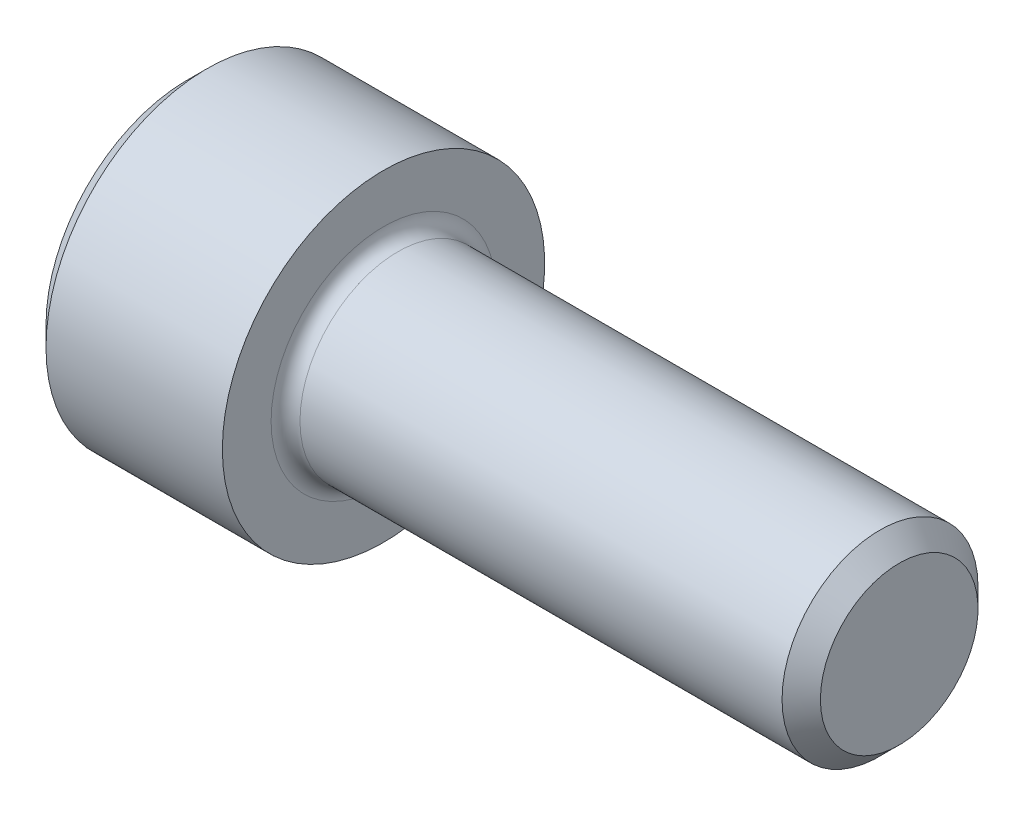
ISO-10303-21;
HEADER;
FILE_DESCRIPTION(('STEP AP214'),'2;1');
FILE_NAME('part.step','',(''),(''),'','','');
FILE_SCHEMA(('AUTOMOTIVE_DESIGN { 1 0 10303 214 1 1 1 1 }'));
ENDSEC;
DATA;
#1=APPLICATION_CONTEXT('core data for automotive mechanical design processes');
#2=APPLICATION_PROTOCOL_DEFINITION('international standard','automotive_design',2000,#1);
#3=PRODUCT_CONTEXT('',#1,'mechanical');
#4=PRODUCT('Part','Part','',(#3));
#5=PRODUCT_RELATED_PRODUCT_CATEGORY('part','',(#4));
#6=PRODUCT_DEFINITION_FORMATION('','',#4);
#7=PRODUCT_DEFINITION_CONTEXT('part definition',#1,'design');
#8=PRODUCT_DEFINITION('design','',#6,#7);
#9=PRODUCT_DEFINITION_SHAPE('','',#8);
#10=(LENGTH_UNIT() NAMED_UNIT(*) SI_UNIT(.MILLI.,.METRE.));
#11=(NAMED_UNIT(*) PLANE_ANGLE_UNIT() SI_UNIT($,.RADIAN.));
#12=(NAMED_UNIT(*) SI_UNIT($,.STERADIAN.) SOLID_ANGLE_UNIT());
#13=UNCERTAINTY_MEASURE_WITH_UNIT(LENGTH_MEASURE(1.E-05),#10,'distance_accuracy_value','');
#14=(GEOMETRIC_REPRESENTATION_CONTEXT(3) GLOBAL_UNCERTAINTY_ASSIGNED_CONTEXT((#13)) GLOBAL_UNIT_ASSIGNED_CONTEXT((#10,
#11,#12)) REPRESENTATION_CONTEXT('',''));
#15=CARTESIAN_POINT('',(0.,0.,0.));
#16=DIRECTION('',(0.,0.,1.));
#17=DIRECTION('',(1.,0.,0.));
#18=AXIS2_PLACEMENT_3D('',#15,#16,#17);
#19=CARTESIAN_POINT('',(0.,0.,0.));
#20=DIRECTION('',(-1.,0.,0.));
#21=DIRECTION('',(0.,0.,1.));
#22=AXIS2_PLACEMENT_3D('',#19,#20,#21);
#23=PLANE('',#22);
#24=DIRECTION('',(0.,-0.499999999999998,0.86602540378444));
#25=VECTOR('',#24,1.);
#26=CARTESIAN_POINT('',(0.,2.2920921156882,0.));
#27=LINE('',#26,#25);
#28=CARTESIAN_POINT('',(0.,2.2920921156882,0.));
#29=VERTEX_POINT('',#28);
#30=CARTESIAN_POINT('',(0.,1.14604605784411,1.98501));
#31=VERTEX_POINT('',#30);
#32=EDGE_CURVE('E270',#29,#31,#27,.T.);
#33=ORIENTED_EDGE('',*,*,#32,.T.);
#34=DIRECTION('',(0.,1.,0.));
#35=VECTOR('',#34,1.);
#36=CARTESIAN_POINT('',(0.,-1.14604605784409,1.98501));
#37=LINE('',#36,#35);
#38=CARTESIAN_POINT('',(0.,-1.14604605784409,1.98501));
#39=VERTEX_POINT('',#38);
#40=EDGE_CURVE('E130',#39,#31,#37,.T.);
#41=ORIENTED_EDGE('',*,*,#40,.F.);
#42=DIRECTION('',(0.,-0.500000000000001,-0.866025403784438));
#43=VECTOR('',#42,1.);
#44=CARTESIAN_POINT('',(0.,-1.14604605784409,1.98501));
#45=LINE('',#44,#43);
#46=CARTESIAN_POINT('',(0.,-2.29209211568819,0.));
#47=VERTEX_POINT('',#46);
#48=EDGE_CURVE('E273',#39,#47,#45,.T.);
#49=ORIENTED_EDGE('',*,*,#48,.T.);
#50=DIRECTION('',(0.,0.499999999999999,-0.86602540378444));
#51=VECTOR('',#50,1.);
#52=CARTESIAN_POINT('',(0.,-2.29209211568819,0.));
#53=LINE('',#52,#51);
#54=CARTESIAN_POINT('',(0.,-1.1460460578441,-1.98501));
#55=VERTEX_POINT('',#54);
#56=EDGE_CURVE('E276',#47,#55,#53,.T.);
#57=ORIENTED_EDGE('',*,*,#56,.T.);
#58=DIRECTION('',(0.,-1.,0.));
#59=VECTOR('',#58,1.);
#60=CARTESIAN_POINT('',(0.,1.1460460578441,-1.98501));
#61=LINE('',#60,#59);
#62=CARTESIAN_POINT('',(0.,1.1460460578441,-1.98501));
#63=VERTEX_POINT('',#62);
#64=EDGE_CURVE('E279',#63,#55,#61,.T.);
#65=ORIENTED_EDGE('',*,*,#64,.F.);
#66=DIRECTION('',(0.,-0.500000000000002,-0.866025403784438));
#67=VECTOR('',#66,1.);
#68=CARTESIAN_POINT('',(0.,2.2920921156882,0.));
#69=LINE('',#68,#67);
#70=EDGE_CURVE('E125',#29,#63,#69,.T.);
#71=ORIENTED_EDGE('',*,*,#70,.F.);
#72=EDGE_LOOP('',(#33,#41,#49,#57,#65,#71));
#73=FACE_BOUND('',#72,.T.);
#74=CARTESIAN_POINT('',(0.,0.,0.));
#75=DIRECTION('',(-1.,0.,0.));
#76=DIRECTION('',(0.,0.,1.));
#77=AXIS2_PLACEMENT_3D('',#74,#75,#76);
#78=CIRCLE('',#77,3.48615);
#79=CARTESIAN_POINT('',(0.,0.,3.48615));
#80=VERTEX_POINT('',#79);
#81=EDGE_CURVE('E154',#80,#80,#78,.T.);
#82=ORIENTED_EDGE('',*,*,#81,.T.);
#83=EDGE_LOOP('',(#82));
#84=FACE_BOUND('',#83,.T.);
#85=ADVANCED_FACE('F38',(#73,#84),#23,.T.);
#86=CARTESIAN_POINT('',(0.,0.,0.));
#87=DIRECTION('',(1.,0.,0.));
#88=DIRECTION('',(0.,0.,-1.));
#89=AXIS2_PLACEMENT_3D('',#86,#87,#88);
#90=CONICAL_SURFACE('',#89,3.48615,0.785398163397451);
#91=CARTESIAN_POINT('',(0.4826,0.,0.));
#92=DIRECTION('',(-1.,0.,0.));
#93=DIRECTION('',(0.,0.,1.));
#94=AXIS2_PLACEMENT_3D('',#91,#92,#93);
#95=CIRCLE('',#94,3.96875);
#96=CARTESIAN_POINT('',(0.4826,0.,3.96875));
#97=VERTEX_POINT('',#96);
#98=EDGE_CURVE('E151',#97,#97,#95,.T.);
#99=ORIENTED_EDGE('',*,*,#98,.T.);
#100=EDGE_LOOP('',(#99));
#101=FACE_BOUND('',#100,.T.);
#102=ORIENTED_EDGE('',*,*,#81,.F.);
#103=EDGE_LOOP('',(#102));
#104=FACE_BOUND('',#103,.T.);
#105=ADVANCED_FACE('F175',(#101,#104),#90,.T.);
#106=CARTESIAN_POINT('',(-31.75,0.,0.));
#107=DIRECTION('',(-1.,0.,0.));
#108=DIRECTION('',(0.,0.,1.));
#109=AXIS2_PLACEMENT_3D('',#106,#107,#108);
#110=CYLINDRICAL_SURFACE('',#109,3.96875);
#111=CARTESIAN_POINT('',(4.826,0.,0.));
#112=DIRECTION('',(-1.,0.,0.));
#113=DIRECTION('',(0.,0.,1.));
#114=AXIS2_PLACEMENT_3D('',#111,#112,#113);
#115=CIRCLE('',#114,3.96875);
#116=CARTESIAN_POINT('',(4.826,0.,3.96875));
#117=VERTEX_POINT('',#116);
#118=EDGE_CURVE('E148',#117,#117,#115,.T.);
#119=ORIENTED_EDGE('',*,*,#118,.T.);
#120=EDGE_LOOP('',(#119));
#121=FACE_BOUND('',#120,.T.);
#122=ORIENTED_EDGE('',*,*,#98,.F.);
#123=EDGE_LOOP('',(#122));
#124=FACE_BOUND('',#123,.T.);
#125=ADVANCED_FACE('F180',(#121,#124),#110,.T.);
#126=CARTESIAN_POINT('',(4.826,3.96875,0.));
#127=DIRECTION('',(1.,0.,0.));
#128=DIRECTION('',(0.,0.,-1.));
#129=AXIS2_PLACEMENT_3D('',#126,#127,#128);
#130=PLANE('',#129);
#131=CARTESIAN_POINT('',(4.826,0.,0.));
#132=DIRECTION('',(1.,0.,0.));
#133=DIRECTION('',(0.,0.,-1.));
#134=AXIS2_PLACEMENT_3D('',#131,#132,#133);
#135=CIRCLE('',#134,2.76859999999999);
#136=CARTESIAN_POINT('',(4.826,0.,-2.76859999999999));
#137=VERTEX_POINT('',#136);
#138=EDGE_CURVE('E46',#137,#137,#135,.F.);
#139=ORIENTED_EDGE('',*,*,#138,.T.);
#140=EDGE_LOOP('',(#139));
#141=FACE_BOUND('',#140,.T.);
#142=ORIENTED_EDGE('',*,*,#118,.F.);
#143=EDGE_LOOP('',(#142));
#144=FACE_BOUND('',#143,.T.);
#145=ADVANCED_FACE('F159',(#141,#144),#130,.T.);
#146=CARTESIAN_POINT('',(-31.75,0.,0.));
#147=DIRECTION('',(-1.,0.,0.));
#148=DIRECTION('',(0.,0.,1.));
#149=AXIS2_PLACEMENT_3D('',#146,#147,#148);
#150=CYLINDRICAL_SURFACE('',#149,2.41299999999999);
#151=CARTESIAN_POINT('',(5.1816,0.,0.));
#152=DIRECTION('',(1.,0.,0.));
#153=DIRECTION('',(0.,0.,-1.));
#154=AXIS2_PLACEMENT_3D('',#151,#152,#153);
#155=CIRCLE('',#154,2.41299999999999);
#156=CARTESIAN_POINT('',(5.1816,0.,-2.41299999999999));
#157=VERTEX_POINT('',#156);
#158=EDGE_CURVE('E11',#157,#157,#155,.T.);
#159=ORIENTED_EDGE('',*,*,#158,.T.);
#160=EDGE_LOOP('',(#159));
#161=FACE_BOUND('',#160,.T.);
#162=CARTESIAN_POINT('',(17.05356,0.,0.));
#163=DIRECTION('',(-1.,0.,0.));
#164=DIRECTION('',(0.,0.,1.));
#165=AXIS2_PLACEMENT_3D('',#162,#163,#164);
#166=CIRCLE('',#165,2.41299999999997);
#167=CARTESIAN_POINT('',(17.05356,0.,2.41299999999997));
#168=VERTEX_POINT('',#167);
#169=EDGE_CURVE('E145',#168,#168,#166,.T.);
#170=ORIENTED_EDGE('',*,*,#169,.T.);
#171=EDGE_LOOP('',(#170));
#172=FACE_BOUND('',#171,.T.);
#173=ADVANCED_FACE('F190',(#161,#172),#150,.T.);
#174=CARTESIAN_POINT('',(17.526,0.,0.));
#175=DIRECTION('',(-1.,0.,0.));
#176=DIRECTION('',(0.,0.,1.));
#177=AXIS2_PLACEMENT_3D('',#174,#175,#176);
#178=CONICAL_SURFACE('',#177,1.94056,0.7853981633974);
#179=ORIENTED_EDGE('',*,*,#169,.F.);
#180=EDGE_LOOP('',(#179));
#181=FACE_BOUND('',#180,.T.);
#182=CARTESIAN_POINT('',(17.526,0.,0.));
#183=DIRECTION('',(-1.,0.,0.));
#184=DIRECTION('',(0.,0.,1.));
#185=AXIS2_PLACEMENT_3D('',#182,#183,#184);
#186=CIRCLE('',#185,1.94056);
#187=CARTESIAN_POINT('',(17.526,0.,1.94056));
#188=VERTEX_POINT('',#187);
#189=EDGE_CURVE('E141',#188,#188,#186,.T.);
#190=ORIENTED_EDGE('',*,*,#189,.T.);
#191=EDGE_LOOP('',(#190));
#192=FACE_BOUND('',#191,.T.);
#193=ADVANCED_FACE('F170',(#181,#192),#178,.T.);
#194=CARTESIAN_POINT('',(17.526,1.94056,0.));
#195=DIRECTION('',(1.,0.,0.));
#196=DIRECTION('',(0.,0.,-1.));
#197=AXIS2_PLACEMENT_3D('',#194,#195,#196);
#198=PLANE('',#197);
#199=ORIENTED_EDGE('',*,*,#189,.F.);
#200=EDGE_LOOP('',(#199));
#201=FACE_BOUND('',#200,.T.);
#202=ADVANCED_FACE('F163',(#201),#198,.T.);
#203=CARTESIAN_POINT('',(5.1816,0.,0.));
#204=DIRECTION('',(1.,0.,0.));
#205=DIRECTION('',(0.,0.,-1.));
#206=AXIS2_PLACEMENT_3D('',#203,#204,#205);
#207=TOROIDAL_SURFACE('',#206,2.76859999999999,0.3556);
#208=ORIENTED_EDGE('',*,*,#158,.F.);
#209=EDGE_LOOP('',(#208));
#210=FACE_BOUND('',#209,.T.);
#211=ORIENTED_EDGE('',*,*,#138,.F.);
#212=EDGE_LOOP('',(#211));
#213=FACE_BOUND('',#212,.T.);
#214=ADVANCED_FACE('F40',(#210,#213),#207,.F.);
#215=CARTESIAN_POINT('',(2.286,2.2920921156882,0.));
#216=DIRECTION('',(0.,-0.866025403784439,-0.499999999999998));
#217=DIRECTION('',(0.,0.499999999999998,-0.86602540378444));
#218=AXIS2_PLACEMENT_3D('',#215,#216,#217);
#219=PLANE('',#218);
#220=ORIENTED_EDGE('',*,*,#32,.F.);
#221=DIRECTION('',(-1.,0.,0.));
#222=VECTOR('',#221,1.);
#223=CARTESIAN_POINT('',(2.286,2.2920921156882,0.));
#224=LINE('',#223,#222);
#225=CARTESIAN_POINT('',(2.286,2.2920921156882,0.));
#226=VERTEX_POINT('',#225);
#227=EDGE_CURVE('E269',#226,#29,#224,.T.);
#228=ORIENTED_EDGE('',*,*,#227,.F.);
#229=DIRECTION('',(0.,-0.499999999999998,0.86602540378444));
#230=VECTOR('',#229,1.);
#231=CARTESIAN_POINT('',(2.286,2.2920921156882,0.));
#232=LINE('',#231,#230);
#233=CARTESIAN_POINT('',(2.286,1.71906908676615,0.992504999999996));
#234=VERTEX_POINT('',#233);
#235=EDGE_CURVE('E53',#226,#234,#232,.T.);
#236=ORIENTED_EDGE('',*,*,#235,.T.);
#237=CARTESIAN_POINT('',(2.286,1.14604605784411,1.98501));
#238=VERTEX_POINT('',#237);
#239=EDGE_CURVE('E111',#234,#238,#232,.T.);
#240=ORIENTED_EDGE('',*,*,#239,.T.);
#241=DIRECTION('',(-1.,0.,0.));
#242=VECTOR('',#241,1.);
#243=CARTESIAN_POINT('',(2.286,1.14604605784411,1.98501));
#244=LINE('',#243,#242);
#245=EDGE_CURVE('E123',#238,#31,#244,.T.);
#246=ORIENTED_EDGE('',*,*,#245,.T.);
#247=EDGE_LOOP('',(#220,#228,#236,#240,#246));
#248=FACE_BOUND('',#247,.T.);
#249=ADVANCED_FACE('F122',(#248),#219,.T.);
#250=CARTESIAN_POINT('',(2.286,-1.14604605784409,1.98501));
#251=DIRECTION('',(0.,0.,1.));
#252=DIRECTION('',(0.,-1.,0.));
#253=AXIS2_PLACEMENT_3D('',#250,#251,#252);
#254=PLANE('',#253);
#255=ORIENTED_EDGE('',*,*,#40,.T.);
#256=ORIENTED_EDGE('',*,*,#245,.F.);
#257=DIRECTION('',(0.,1.,0.));
#258=VECTOR('',#257,1.);
#259=CARTESIAN_POINT('',(2.286,-1.14604605784409,1.98501));
#260=LINE('',#259,#258);
#261=CARTESIAN_POINT('',(2.286,0.,1.98501));
#262=VERTEX_POINT('',#261);
#263=EDGE_CURVE('E109',#262,#238,#260,.T.);
#264=ORIENTED_EDGE('',*,*,#263,.F.);
#265=CARTESIAN_POINT('',(2.286,-1.14604605784409,1.98501));
#266=VERTEX_POINT('',#265);
#267=EDGE_CURVE('E119',#266,#262,#260,.T.);
#268=ORIENTED_EDGE('',*,*,#267,.F.);
#269=DIRECTION('',(-1.,0.,0.));
#270=VECTOR('',#269,1.);
#271=CARTESIAN_POINT('',(2.286,-1.14604605784409,1.98501));
#272=LINE('',#271,#270);
#273=EDGE_CURVE('E132',#266,#39,#272,.T.);
#274=ORIENTED_EDGE('',*,*,#273,.T.);
#275=EDGE_LOOP('',(#255,#256,#264,#268,#274));
#276=FACE_BOUND('',#275,.T.);
#277=ADVANCED_FACE('F127',(#276),#254,.F.);
#278=CARTESIAN_POINT('',(2.286,-1.14604605784409,1.98501));
#279=DIRECTION('',(0.,0.866025403784438,-0.500000000000001));
#280=DIRECTION('',(0.,0.500000000000001,0.866025403784438));
#281=AXIS2_PLACEMENT_3D('',#278,#279,#280);
#282=PLANE('',#281);
#283=ORIENTED_EDGE('',*,*,#48,.F.);
#284=ORIENTED_EDGE('',*,*,#273,.F.);
#285=DIRECTION('',(0.,-0.500000000000001,-0.866025403784438));
#286=VECTOR('',#285,1.);
#287=CARTESIAN_POINT('',(2.286,-1.14604605784409,1.98501));
#288=LINE('',#287,#286);
#289=CARTESIAN_POINT('',(2.286,-1.71906908676614,0.992505));
#290=VERTEX_POINT('',#289);
#291=EDGE_CURVE('E250',#266,#290,#288,.T.);
#292=ORIENTED_EDGE('',*,*,#291,.T.);
#293=CARTESIAN_POINT('',(2.286,-2.29209211568819,0.));
#294=VERTEX_POINT('',#293);
#295=EDGE_CURVE('E252',#290,#294,#288,.T.);
#296=ORIENTED_EDGE('',*,*,#295,.T.);
#297=DIRECTION('',(-1.,0.,0.));
#298=VECTOR('',#297,1.);
#299=CARTESIAN_POINT('',(2.286,-2.29209211568819,0.));
#300=LINE('',#299,#298);
#301=EDGE_CURVE('E137',#294,#47,#300,.T.);
#302=ORIENTED_EDGE('',*,*,#301,.T.);
#303=EDGE_LOOP('',(#283,#284,#292,#296,#302));
#304=FACE_BOUND('',#303,.T.);
#305=ADVANCED_FACE('F202',(#304),#282,.T.);
#306=CARTESIAN_POINT('',(2.286,-2.29209211568819,0.));
#307=DIRECTION('',(0.,0.866025403784439,0.499999999999999));
#308=DIRECTION('',(0.,-0.499999999999999,0.866025403784439));
#309=AXIS2_PLACEMENT_3D('',#306,#307,#308);
#310=PLANE('',#309);
#311=ORIENTED_EDGE('',*,*,#56,.F.);
#312=ORIENTED_EDGE('',*,*,#301,.F.);
#313=DIRECTION('',(0.,0.499999999999999,-0.86602540378444));
#314=VECTOR('',#313,1.);
#315=CARTESIAN_POINT('',(2.286,-2.29209211568819,0.));
#316=LINE('',#315,#314);
#317=CARTESIAN_POINT('',(2.286,-1.71906908676615,-0.992504999999996));
#318=VERTEX_POINT('',#317);
#319=EDGE_CURVE('E255',#294,#318,#316,.T.);
#320=ORIENTED_EDGE('',*,*,#319,.T.);
#321=CARTESIAN_POINT('',(2.286,-1.1460460578441,-1.98501));
#322=VERTEX_POINT('',#321);
#323=EDGE_CURVE('E259',#318,#322,#316,.T.);
#324=ORIENTED_EDGE('',*,*,#323,.T.);
#325=DIRECTION('',(-1.,0.,0.));
#326=VECTOR('',#325,1.);
#327=CARTESIAN_POINT('',(2.286,-1.1460460578441,-1.98501));
#328=LINE('',#327,#326);
#329=EDGE_CURVE('E288',#322,#55,#328,.T.);
#330=ORIENTED_EDGE('',*,*,#329,.T.);
#331=EDGE_LOOP('',(#311,#312,#320,#324,#330));
#332=FACE_BOUND('',#331,.T.);
#333=ADVANCED_FACE('F205',(#332),#310,.T.);
#334=CARTESIAN_POINT('',(2.286,1.1460460578441,-1.98501));
#335=DIRECTION('',(0.,0.,-1.));
#336=DIRECTION('',(0.,1.,0.));
#337=AXIS2_PLACEMENT_3D('',#334,#335,#336);
#338=PLANE('',#337);
#339=ORIENTED_EDGE('',*,*,#64,.T.);
#340=ORIENTED_EDGE('',*,*,#329,.F.);
#341=DIRECTION('',(0.,-1.,0.));
#342=VECTOR('',#341,1.);
#343=CARTESIAN_POINT('',(2.286,1.1460460578441,-1.98501));
#344=LINE('',#343,#342);
#345=CARTESIAN_POINT('',(2.286,0.,-1.98501));
#346=VERTEX_POINT('',#345);
#347=EDGE_CURVE('E263',#346,#322,#344,.T.);
#348=ORIENTED_EDGE('',*,*,#347,.F.);
#349=CARTESIAN_POINT('',(2.286,1.1460460578441,-1.98501));
#350=VERTEX_POINT('',#349);
#351=EDGE_CURVE('E264',#350,#346,#344,.T.);
#352=ORIENTED_EDGE('',*,*,#351,.F.);
#353=DIRECTION('',(-1.,0.,0.));
#354=VECTOR('',#353,1.);
#355=CARTESIAN_POINT('',(2.286,1.1460460578441,-1.98501));
#356=LINE('',#355,#354);
#357=EDGE_CURVE('E285',#350,#63,#356,.T.);
#358=ORIENTED_EDGE('',*,*,#357,.T.);
#359=EDGE_LOOP('',(#339,#340,#348,#352,#358));
#360=FACE_BOUND('',#359,.T.);
#361=ADVANCED_FACE('F209',(#360),#338,.F.);
#362=CARTESIAN_POINT('',(2.286,2.2920921156882,0.));
#363=DIRECTION('',(0.,0.866025403784438,-0.500000000000002));
#364=DIRECTION('',(0.,0.500000000000002,0.866025403784438));
#365=AXIS2_PLACEMENT_3D('',#362,#363,#364);
#366=PLANE('',#365);
#367=ORIENTED_EDGE('',*,*,#70,.T.);
#368=ORIENTED_EDGE('',*,*,#357,.F.);
#369=DIRECTION('',(0.,-0.500000000000002,-0.866025403784438));
#370=VECTOR('',#369,1.);
#371=CARTESIAN_POINT('',(2.286,2.2920921156882,0.));
#372=LINE('',#371,#370);
#373=CARTESIAN_POINT('',(2.286,1.71906908676615,-0.992505000000006));
#374=VERTEX_POINT('',#373);
#375=EDGE_CURVE('E267',#374,#350,#372,.T.);
#376=ORIENTED_EDGE('',*,*,#375,.F.);
#377=EDGE_CURVE('E241',#226,#374,#372,.T.);
#378=ORIENTED_EDGE('',*,*,#377,.F.);
#379=ORIENTED_EDGE('',*,*,#227,.T.);
#380=EDGE_LOOP('',(#367,#368,#376,#378,#379));
#381=FACE_BOUND('',#380,.T.);
#382=ADVANCED_FACE('F213',(#381),#366,.F.);
#383=CARTESIAN_POINT('',(2.286,1.14604605784411,1.98501));
#384=DIRECTION('',(-1.,0.,0.));
#385=DIRECTION('',(0.,0.,1.));
#386=AXIS2_PLACEMENT_3D('',#383,#384,#385);
#387=PLANE('',#386);
#388=CARTESIAN_POINT('',(2.286,0.,0.));
#389=DIRECTION('',(-1.,0.,0.));
#390=DIRECTION('',(0.,0.,1.));
#391=AXIS2_PLACEMENT_3D('',#388,#389,#390);
#392=CIRCLE('',#391,1.98501);
#393=EDGE_CURVE('E131',#290,#262,#392,.T.);
#394=ORIENTED_EDGE('',*,*,#393,.F.);
#395=ORIENTED_EDGE('',*,*,#291,.F.);
#396=ORIENTED_EDGE('',*,*,#267,.T.);
#397=EDGE_LOOP('',(#394,#395,#396));
#398=FACE_BOUND('',#397,.T.);
#399=ADVANCED_FACE('F217',(#398),#387,.T.);
#400=EDGE_CURVE('E135',#318,#290,#392,.T.);
#401=ORIENTED_EDGE('',*,*,#400,.F.);
#402=ORIENTED_EDGE('',*,*,#319,.F.);
#403=ORIENTED_EDGE('',*,*,#295,.F.);
#404=EDGE_LOOP('',(#401,#402,#403));
#405=FACE_BOUND('',#404,.T.);
#406=ADVANCED_FACE('F220',(#405),#387,.T.);
#407=EDGE_CURVE('E294',#346,#318,#392,.T.);
#408=ORIENTED_EDGE('',*,*,#407,.F.);
#409=ORIENTED_EDGE('',*,*,#347,.T.);
#410=ORIENTED_EDGE('',*,*,#323,.F.);
#411=EDGE_LOOP('',(#408,#409,#410));
#412=FACE_BOUND('',#411,.T.);
#413=ADVANCED_FACE('F225',(#412),#387,.T.);
#414=EDGE_CURVE('E244',#374,#346,#392,.T.);
#415=ORIENTED_EDGE('',*,*,#414,.F.);
#416=ORIENTED_EDGE('',*,*,#375,.T.);
#417=ORIENTED_EDGE('',*,*,#351,.T.);
#418=EDGE_LOOP('',(#415,#416,#417));
#419=FACE_BOUND('',#418,.T.);
#420=ADVANCED_FACE('F232',(#419),#387,.T.);
#421=EDGE_CURVE('E142',#234,#374,#392,.T.);
#422=ORIENTED_EDGE('',*,*,#421,.F.);
#423=ORIENTED_EDGE('',*,*,#235,.F.);
#424=ORIENTED_EDGE('',*,*,#377,.T.);
#425=EDGE_LOOP('',(#422,#423,#424));
#426=FACE_BOUND('',#425,.T.);
#427=ADVANCED_FACE('F228',(#426),#387,.T.);
#428=EDGE_CURVE('E114',#262,#234,#392,.T.);
#429=ORIENTED_EDGE('',*,*,#428,.F.);
#430=ORIENTED_EDGE('',*,*,#263,.T.);
#431=ORIENTED_EDGE('',*,*,#239,.F.);
#432=EDGE_LOOP('',(#429,#430,#431));
#433=FACE_BOUND('',#432,.T.);
#434=ADVANCED_FACE('F110',(#433),#387,.T.);
#435=CARTESIAN_POINT('',(2.286,0.,0.));
#436=DIRECTION('',(-1.,0.,0.));
#437=DIRECTION('',(0.,0.,1.));
#438=AXIS2_PLACEMENT_3D('',#435,#436,#437);
#439=CONICAL_SURFACE('',#438,1.98501,1.04719755119659);
#440=CARTESIAN_POINT('',(3.43204605784411,0.,0.));
#441=VERTEX_POINT('',#440);
#442=VERTEX_LOOP('',#441);
#443=FACE_BOUND('',#442,.T.);
#444=ORIENTED_EDGE('',*,*,#428,.T.);
#445=ORIENTED_EDGE('',*,*,#421,.T.);
#446=ORIENTED_EDGE('',*,*,#414,.T.);
#447=ORIENTED_EDGE('',*,*,#407,.T.);
#448=ORIENTED_EDGE('',*,*,#400,.T.);
#449=ORIENTED_EDGE('',*,*,#393,.T.);
#450=EDGE_LOOP('',(#444,#445,#446,#447,#448,#449));
#451=FACE_BOUND('',#450,.T.);
#452=ADVANCED_FACE('F197',(#443,#451),#439,.F.);
#453=CLOSED_SHELL('',(#85,#105,#125,#145,#173,#193,#202,#214,#249,#277,#305,#333,#361,#382,#399,
#406,#413,#420,#427,#434,#452));
#454=MANIFOLD_SOLID_BREP('B2',#453);
#455=ADVANCED_BREP_SHAPE_REPRESENTATION('',(#18,#454),#14);
#456=SHAPE_DEFINITION_REPRESENTATION(#9,#455);
ENDSEC;
END-ISO-10303-21;
